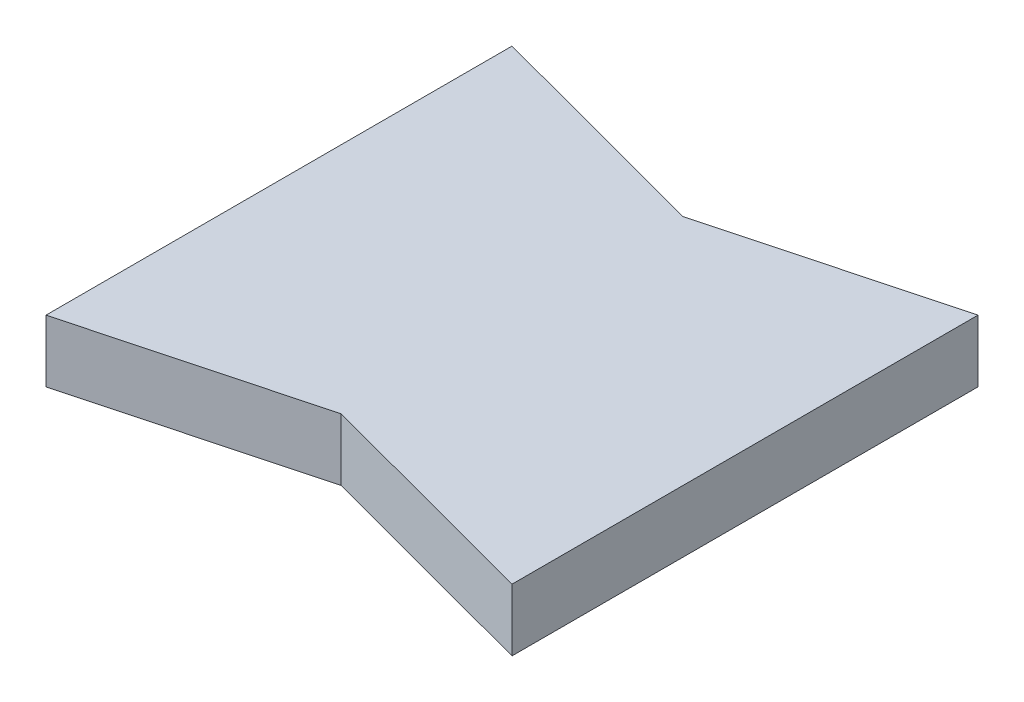
ISO-10303-21;
HEADER;
FILE_DESCRIPTION(('STEP AP214'),'2;1');
FILE_NAME('part.step','',(''),(''),'','','');
FILE_SCHEMA(('AUTOMOTIVE_DESIGN { 1 0 10303 214 1 1 1 1 }'));
ENDSEC;
DATA;
#1=APPLICATION_CONTEXT('core data for automotive mechanical design processes');
#2=APPLICATION_PROTOCOL_DEFINITION('international standard','automotive_design',2000,#1);
#3=PRODUCT_CONTEXT('',#1,'mechanical');
#4=PRODUCT('Part','Part','',(#3));
#5=PRODUCT_RELATED_PRODUCT_CATEGORY('part','',(#4));
#6=PRODUCT_DEFINITION_FORMATION('','',#4);
#7=PRODUCT_DEFINITION_CONTEXT('part definition',#1,'design');
#8=PRODUCT_DEFINITION('design','',#6,#7);
#9=PRODUCT_DEFINITION_SHAPE('','',#8);
#10=(LENGTH_UNIT() NAMED_UNIT(*) SI_UNIT(.MILLI.,.METRE.));
#11=(NAMED_UNIT(*) PLANE_ANGLE_UNIT() SI_UNIT($,.RADIAN.));
#12=(NAMED_UNIT(*) SI_UNIT($,.STERADIAN.) SOLID_ANGLE_UNIT());
#13=UNCERTAINTY_MEASURE_WITH_UNIT(LENGTH_MEASURE(1.E-05),#10,'distance_accuracy_value','');
#14=(GEOMETRIC_REPRESENTATION_CONTEXT(3) GLOBAL_UNCERTAINTY_ASSIGNED_CONTEXT((#13)) GLOBAL_UNIT_ASSIGNED_CONTEXT((#10,
#11,#12)) REPRESENTATION_CONTEXT('',''));
#15=CARTESIAN_POINT('',(0.,0.,0.));
#16=DIRECTION('',(0.,0.,1.));
#17=DIRECTION('',(1.,0.,0.));
#18=AXIS2_PLACEMENT_3D('',#15,#16,#17);
#19=CARTESIAN_POINT('',(-33.992673992674,4.,-12.1245421245421));
#20=DIRECTION('',(1.,0.,0.));
#21=DIRECTION('',(0.,0.,-1.));
#22=AXIS2_PLACEMENT_3D('',#19,#20,#21);
#23=PLANE('',#22);
#24=DIRECTION('',(0.,0.,1.));
#25=VECTOR('',#24,1.);
#26=CARTESIAN_POINT('',(-33.992673992674,0.,-12.1245421245421));
#27=LINE('',#26,#25);
#28=CARTESIAN_POINT('',(-33.992673992674,0.,-12.1245421245421));
#29=VERTEX_POINT('',#28);
#30=CARTESIAN_POINT('',(-33.992673992674,0.,17.8754578754579));
#31=VERTEX_POINT('',#30);
#32=EDGE_CURVE('E117',#29,#31,#27,.T.);
#33=ORIENTED_EDGE('',*,*,#32,.T.);
#34=DIRECTION('',(0.,-1.,0.));
#35=VECTOR('',#34,1.);
#36=CARTESIAN_POINT('',(-33.992673992674,4.,17.8754578754579));
#37=LINE('',#36,#35);
#38=CARTESIAN_POINT('',(-33.992673992674,4.,17.8754578754579));
#39=VERTEX_POINT('',#38);
#40=EDGE_CURVE('E11',#39,#31,#37,.T.);
#41=ORIENTED_EDGE('',*,*,#40,.F.);
#42=DIRECTION('',(0.,0.,1.));
#43=VECTOR('',#42,1.);
#44=CARTESIAN_POINT('',(-33.992673992674,4.,-12.1245421245421));
#45=LINE('',#44,#43);
#46=CARTESIAN_POINT('',(-33.992673992674,4.,-12.1245421245421));
#47=VERTEX_POINT('',#46);
#48=EDGE_CURVE('E127',#47,#39,#45,.T.);
#49=ORIENTED_EDGE('',*,*,#48,.F.);
#50=DIRECTION('',(0.,-1.,0.));
#51=VECTOR('',#50,1.);
#52=CARTESIAN_POINT('',(-33.992673992674,4.,-12.1245421245421));
#53=LINE('',#52,#51);
#54=EDGE_CURVE('E113',#47,#29,#53,.T.);
#55=ORIENTED_EDGE('',*,*,#54,.T.);
#56=EDGE_LOOP('',(#33,#41,#49,#55));
#57=FACE_BOUND('',#56,.T.);
#58=ADVANCED_FACE('F33',(#57),#23,.F.);
#59=CARTESIAN_POINT('',(-33.992673992674,4.,17.8754578754579));
#60=DIRECTION('',(-0.257662650560332,0.,-0.966234939601246));
#61=DIRECTION('',(-0.966234939601246,0.,0.257662650560332));
#62=AXIS2_PLACEMENT_3D('',#59,#60,#61);
#63=PLANE('',#62);
#64=DIRECTION('',(0.966234939601246,0.,-0.257662650560332));
#65=VECTOR('',#64,1.);
#66=CARTESIAN_POINT('',(-33.992673992674,0.,17.8754578754579));
#67=LINE('',#66,#65);
#68=CARTESIAN_POINT('',(-18.992673992674,0.,13.8754578754579));
#69=VERTEX_POINT('',#68);
#70=EDGE_CURVE('E120',#31,#69,#67,.T.);
#71=ORIENTED_EDGE('',*,*,#70,.T.);
#72=DIRECTION('',(0.,-1.,0.));
#73=VECTOR('',#72,1.);
#74=CARTESIAN_POINT('',(-18.992673992674,4.,13.8754578754579));
#75=LINE('',#74,#73);
#76=CARTESIAN_POINT('',(-18.992673992674,4.,13.8754578754579));
#77=VERTEX_POINT('',#76);
#78=EDGE_CURVE('E41',#77,#69,#75,.T.);
#79=ORIENTED_EDGE('',*,*,#78,.F.);
#80=DIRECTION('',(0.966234939601246,0.,-0.257662650560332));
#81=VECTOR('',#80,1.);
#82=CARTESIAN_POINT('',(-33.992673992674,4.,17.8754578754579));
#83=LINE('',#82,#81);
#84=EDGE_CURVE('E86',#39,#77,#83,.T.);
#85=ORIENTED_EDGE('',*,*,#84,.F.);
#86=ORIENTED_EDGE('',*,*,#40,.T.);
#87=EDGE_LOOP('',(#71,#79,#85,#86));
#88=FACE_BOUND('',#87,.T.);
#89=ADVANCED_FACE('F151',(#88),#63,.F.);
#90=CARTESIAN_POINT('',(-18.992673992674,4.,13.8754578754579));
#91=DIRECTION('',(0.257662650560332,0.,-0.966234939601246));
#92=DIRECTION('',(-0.966234939601246,0.,-0.257662650560332));
#93=AXIS2_PLACEMENT_3D('',#90,#91,#92);
#94=PLANE('',#93);
#95=DIRECTION('',(0.966234939601246,0.,0.257662650560332));
#96=VECTOR('',#95,1.);
#97=CARTESIAN_POINT('',(-18.992673992674,0.,13.8754578754579));
#98=LINE('',#97,#96);
#99=CARTESIAN_POINT('',(-3.99267399267398,0.,17.8754578754579));
#100=VERTEX_POINT('',#99);
#101=EDGE_CURVE('E122',#69,#100,#98,.T.);
#102=ORIENTED_EDGE('',*,*,#101,.T.);
#103=DIRECTION('',(0.,-1.,0.));
#104=VECTOR('',#103,1.);
#105=CARTESIAN_POINT('',(-3.99267399267398,4.,17.8754578754579));
#106=LINE('',#105,#104);
#107=CARTESIAN_POINT('',(-3.99267399267398,4.,17.8754578754579));
#108=VERTEX_POINT('',#107);
#109=EDGE_CURVE('E108',#108,#100,#106,.T.);
#110=ORIENTED_EDGE('',*,*,#109,.F.);
#111=DIRECTION('',(0.966234939601246,0.,0.257662650560332));
#112=VECTOR('',#111,1.);
#113=CARTESIAN_POINT('',(-18.992673992674,4.,13.8754578754579));
#114=LINE('',#113,#112);
#115=EDGE_CURVE('E99',#77,#108,#114,.T.);
#116=ORIENTED_EDGE('',*,*,#115,.F.);
#117=ORIENTED_EDGE('',*,*,#78,.T.);
#118=EDGE_LOOP('',(#102,#110,#116,#117));
#119=FACE_BOUND('',#118,.T.);
#120=ADVANCED_FACE('F133',(#119),#94,.F.);
#121=CARTESIAN_POINT('',(-3.99267399267399,4.,-12.1245421245421));
#122=DIRECTION('',(-1.,0.,0.));
#123=DIRECTION('',(0.,0.,1.));
#124=AXIS2_PLACEMENT_3D('',#121,#122,#123);
#125=PLANE('',#124);
#126=DIRECTION('',(0.,0.,-1.));
#127=VECTOR('',#126,1.);
#128=CARTESIAN_POINT('',(-3.99267399267399,0.,-12.1245421245421));
#129=LINE('',#128,#127);
#130=CARTESIAN_POINT('',(-3.99267399267399,0.,-12.1245421245421));
#131=VERTEX_POINT('',#130);
#132=EDGE_CURVE('E107',#100,#131,#129,.T.);
#133=ORIENTED_EDGE('',*,*,#132,.T.);
#134=DIRECTION('',(0.,-1.,0.));
#135=VECTOR('',#134,1.);
#136=CARTESIAN_POINT('',(-3.99267399267399,4.,-12.1245421245421));
#137=LINE('',#136,#135);
#138=CARTESIAN_POINT('',(-3.99267399267399,4.,-12.1245421245421));
#139=VERTEX_POINT('',#138);
#140=EDGE_CURVE('E104',#139,#131,#137,.T.);
#141=ORIENTED_EDGE('',*,*,#140,.F.);
#142=DIRECTION('',(0.,0.,-1.));
#143=VECTOR('',#142,1.);
#144=CARTESIAN_POINT('',(-3.99267399267399,4.,-12.1245421245421));
#145=LINE('',#144,#143);
#146=EDGE_CURVE('E93',#108,#139,#145,.T.);
#147=ORIENTED_EDGE('',*,*,#146,.F.);
#148=ORIENTED_EDGE('',*,*,#109,.T.);
#149=EDGE_LOOP('',(#133,#141,#147,#148));
#150=FACE_BOUND('',#149,.T.);
#151=ADVANCED_FACE('F105',(#150),#125,.F.);
#152=CARTESIAN_POINT('',(-18.992673992674,4.,-8.12454212454214));
#153=DIRECTION('',(0.257662650560333,0.,0.966234939601246));
#154=DIRECTION('',(0.966234939601246,0.,-0.257662650560332));
#155=AXIS2_PLACEMENT_3D('',#152,#153,#154);
#156=PLANE('',#155);
#157=DIRECTION('',(-0.966234939601246,0.,0.257662650560332));
#158=VECTOR('',#157,1.);
#159=CARTESIAN_POINT('',(-18.992673992674,0.,-8.12454212454214));
#160=LINE('',#159,#158);
#161=CARTESIAN_POINT('',(-18.992673992674,0.,-8.12454212454214));
#162=VERTEX_POINT('',#161);
#163=EDGE_CURVE('E72',#131,#162,#160,.T.);
#164=ORIENTED_EDGE('',*,*,#163,.T.);
#165=DIRECTION('',(0.,-1.,0.));
#166=VECTOR('',#165,1.);
#167=CARTESIAN_POINT('',(-18.992673992674,4.,-8.12454212454214));
#168=LINE('',#167,#166);
#169=CARTESIAN_POINT('',(-18.992673992674,4.,-8.12454212454214));
#170=VERTEX_POINT('',#169);
#171=EDGE_CURVE('E109',#170,#162,#168,.T.);
#172=ORIENTED_EDGE('',*,*,#171,.F.);
#173=DIRECTION('',(-0.966234939601246,0.,0.257662650560332));
#174=VECTOR('',#173,1.);
#175=CARTESIAN_POINT('',(-18.992673992674,4.,-8.12454212454214));
#176=LINE('',#175,#174);
#177=EDGE_CURVE('E97',#139,#170,#176,.T.);
#178=ORIENTED_EDGE('',*,*,#177,.F.);
#179=ORIENTED_EDGE('',*,*,#140,.T.);
#180=EDGE_LOOP('',(#164,#172,#178,#179));
#181=FACE_BOUND('',#180,.T.);
#182=ADVANCED_FACE('F111',(#181),#156,.F.);
#183=CARTESIAN_POINT('',(-33.992673992674,4.,-12.1245421245421));
#184=DIRECTION('',(-0.257662650560332,0.,0.966234939601246));
#185=DIRECTION('',(0.966234939601246,0.,0.257662650560332));
#186=AXIS2_PLACEMENT_3D('',#183,#184,#185);
#187=PLANE('',#186);
#188=DIRECTION('',(-0.966234939601246,0.,-0.257662650560332));
#189=VECTOR('',#188,1.);
#190=CARTESIAN_POINT('',(-33.992673992674,0.,-12.1245421245421));
#191=LINE('',#190,#189);
#192=EDGE_CURVE('E78',#162,#29,#191,.T.);
#193=ORIENTED_EDGE('',*,*,#192,.T.);
#194=ORIENTED_EDGE('',*,*,#54,.F.);
#195=DIRECTION('',(-0.966234939601246,0.,-0.257662650560332));
#196=VECTOR('',#195,1.);
#197=CARTESIAN_POINT('',(-33.992673992674,4.,-12.1245421245421));
#198=LINE('',#197,#196);
#199=EDGE_CURVE('E49',#170,#47,#198,.T.);
#200=ORIENTED_EDGE('',*,*,#199,.F.);
#201=ORIENTED_EDGE('',*,*,#171,.T.);
#202=EDGE_LOOP('',(#193,#194,#200,#201));
#203=FACE_BOUND('',#202,.T.);
#204=ADVANCED_FACE('F140',(#203),#187,.F.);
#205=CARTESIAN_POINT('',(0.,4.,0.));
#206=DIRECTION('',(0.,1.,0.));
#207=DIRECTION('',(0.,0.,1.));
#208=AXIS2_PLACEMENT_3D('',#205,#206,#207);
#209=PLANE('',#208);
#210=ORIENTED_EDGE('',*,*,#48,.T.);
#211=ORIENTED_EDGE('',*,*,#84,.T.);
#212=ORIENTED_EDGE('',*,*,#115,.T.);
#213=ORIENTED_EDGE('',*,*,#146,.T.);
#214=ORIENTED_EDGE('',*,*,#177,.T.);
#215=ORIENTED_EDGE('',*,*,#199,.T.);
#216=EDGE_LOOP('',(#210,#211,#212,#213,#214,#215));
#217=FACE_BOUND('',#216,.T.);
#218=ADVANCED_FACE('F95',(#217),#209,.T.);
#219=CARTESIAN_POINT('',(0.,0.,0.));
#220=DIRECTION('',(0.,1.,0.));
#221=DIRECTION('',(0.,0.,1.));
#222=AXIS2_PLACEMENT_3D('',#219,#220,#221);
#223=PLANE('',#222);
#224=ORIENTED_EDGE('',*,*,#32,.F.);
#225=ORIENTED_EDGE('',*,*,#192,.F.);
#226=ORIENTED_EDGE('',*,*,#163,.F.);
#227=ORIENTED_EDGE('',*,*,#132,.F.);
#228=ORIENTED_EDGE('',*,*,#101,.F.);
#229=ORIENTED_EDGE('',*,*,#70,.F.);
#230=EDGE_LOOP('',(#224,#225,#226,#227,#228,#229));
#231=FACE_BOUND('',#230,.T.);
#232=ADVANCED_FACE('F136',(#231),#223,.F.);
#233=CLOSED_SHELL('',(#58,#89,#120,#151,#182,#204,#218,#232));
#234=MANIFOLD_SOLID_BREP('B2',#233);
#235=ADVANCED_BREP_SHAPE_REPRESENTATION('',(#18,#234),#14);
#236=SHAPE_DEFINITION_REPRESENTATION(#9,#235);
ENDSEC;
END-ISO-10303-21;
